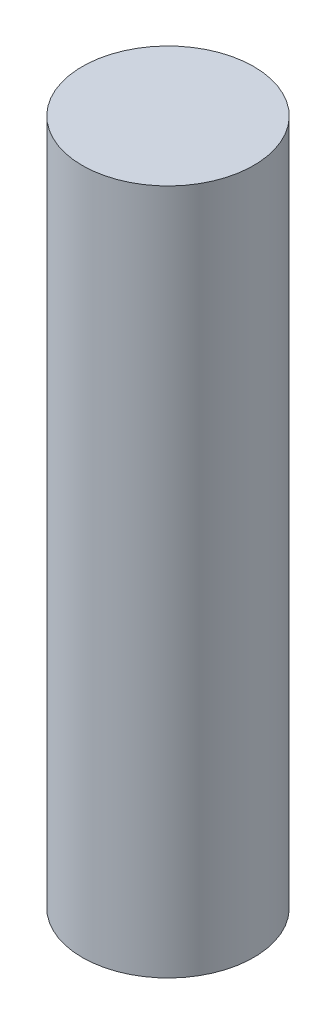
ISO-10303-21;
HEADER;
FILE_DESCRIPTION(('STEP AP214'),'2;1');
FILE_NAME('part.step','',(''),(''),'','','');
FILE_SCHEMA(('AUTOMOTIVE_DESIGN { 1 0 10303 214 1 1 1 1 }'));
ENDSEC;
DATA;
#1=APPLICATION_CONTEXT('core data for automotive mechanical design processes');
#2=APPLICATION_PROTOCOL_DEFINITION('international standard','automotive_design',2000,#1);
#3=PRODUCT_CONTEXT('',#1,'mechanical');
#4=PRODUCT('Part','Part','',(#3));
#5=PRODUCT_RELATED_PRODUCT_CATEGORY('part','',(#4));
#6=PRODUCT_DEFINITION_FORMATION('','',#4);
#7=PRODUCT_DEFINITION_CONTEXT('part definition',#1,'design');
#8=PRODUCT_DEFINITION('design','',#6,#7);
#9=PRODUCT_DEFINITION_SHAPE('','',#8);
#10=(LENGTH_UNIT() NAMED_UNIT(*) SI_UNIT(.MILLI.,.METRE.));
#11=(NAMED_UNIT(*) PLANE_ANGLE_UNIT() SI_UNIT($,.RADIAN.));
#12=(NAMED_UNIT(*) SI_UNIT($,.STERADIAN.) SOLID_ANGLE_UNIT());
#13=UNCERTAINTY_MEASURE_WITH_UNIT(LENGTH_MEASURE(1.E-05),#10,'distance_accuracy_value','');
#14=(GEOMETRIC_REPRESENTATION_CONTEXT(3) GLOBAL_UNCERTAINTY_ASSIGNED_CONTEXT((#13)) GLOBAL_UNIT_ASSIGNED_CONTEXT((#10,
#11,#12)) REPRESENTATION_CONTEXT('',''));
#15=CARTESIAN_POINT('',(0.,0.,0.));
#16=DIRECTION('',(0.,0.,1.));
#17=DIRECTION('',(1.,0.,0.));
#18=AXIS2_PLACEMENT_3D('',#15,#16,#17);
#19=CARTESIAN_POINT('',(0.,40.,0.));
#20=DIRECTION('',(0.,-1.,0.));
#21=DIRECTION('',(0.,0.,-1.));
#22=AXIS2_PLACEMENT_3D('',#19,#20,#21);
#23=CYLINDRICAL_SURFACE('',#22,5.);
#24=CARTESIAN_POINT('',(0.,40.,0.));
#25=DIRECTION('',(0.,1.,0.));
#26=DIRECTION('',(0.,0.,1.));
#27=AXIS2_PLACEMENT_3D('',#24,#25,#26);
#28=CIRCLE('',#27,5.);
#29=CARTESIAN_POINT('',(0.,40.,5.));
#30=VERTEX_POINT('',#29);
#31=EDGE_CURVE('E10',#30,#30,#28,.T.);
#32=ORIENTED_EDGE('',*,*,#31,.F.);
#33=EDGE_LOOP('',(#32));
#34=FACE_BOUND('',#33,.T.);
#35=CARTESIAN_POINT('',(0.,0.,0.));
#36=DIRECTION('',(0.,1.,0.));
#37=DIRECTION('',(0.,0.,1.));
#38=AXIS2_PLACEMENT_3D('',#35,#36,#37);
#39=CIRCLE('',#38,5.);
#40=CARTESIAN_POINT('',(0.,0.,5.));
#41=VERTEX_POINT('',#40);
#42=EDGE_CURVE('E40',#41,#41,#39,.T.);
#43=ORIENTED_EDGE('',*,*,#42,.T.);
#44=EDGE_LOOP('',(#43));
#45=FACE_BOUND('',#44,.T.);
#46=ADVANCED_FACE('F37',(#34,#45),#23,.T.);
#47=CARTESIAN_POINT('',(0.,40.,0.));
#48=DIRECTION('',(0.,1.,0.));
#49=DIRECTION('',(0.,0.,1.));
#50=AXIS2_PLACEMENT_3D('',#47,#48,#49);
#51=PLANE('',#50);
#52=ORIENTED_EDGE('',*,*,#31,.T.);
#53=EDGE_LOOP('',(#52));
#54=FACE_BOUND('',#53,.T.);
#55=ADVANCED_FACE('F54',(#54),#51,.T.);
#56=CARTESIAN_POINT('',(0.,0.,0.));
#57=DIRECTION('',(0.,1.,0.));
#58=DIRECTION('',(0.,0.,1.));
#59=AXIS2_PLACEMENT_3D('',#56,#57,#58);
#60=PLANE('',#59);
#61=ORIENTED_EDGE('',*,*,#42,.F.);
#62=EDGE_LOOP('',(#61));
#63=FACE_BOUND('',#62,.T.);
#64=ADVANCED_FACE('F52',(#63),#60,.F.);
#65=CLOSED_SHELL('',(#46,#55,#64));
#66=MANIFOLD_SOLID_BREP('B2',#65);
#67=ADVANCED_BREP_SHAPE_REPRESENTATION('',(#18,#66),#14);
#68=SHAPE_DEFINITION_REPRESENTATION(#9,#67);
ENDSEC;
END-ISO-10303-21;
